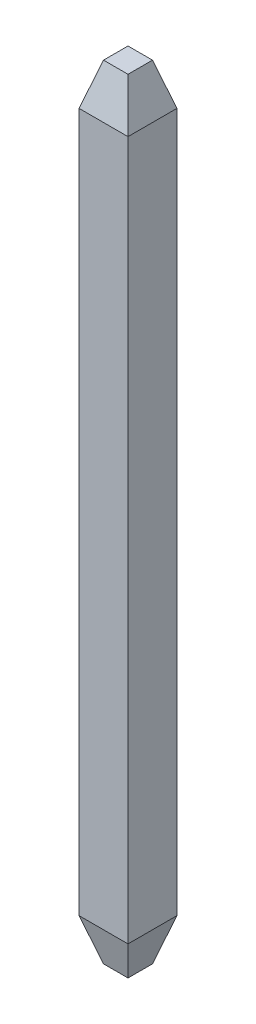
ISO-10303-21;
HEADER;
FILE_DESCRIPTION(('STEP AP214'),'2;1');
FILE_NAME('part.step','',(''),(''),'','','');
FILE_SCHEMA(('AUTOMOTIVE_DESIGN { 1 0 10303 214 1 1 1 1 }'));
ENDSEC;
DATA;
#1=APPLICATION_CONTEXT('core data for automotive mechanical design processes');
#2=APPLICATION_PROTOCOL_DEFINITION('international standard','automotive_design',2000,#1);
#3=PRODUCT_CONTEXT('',#1,'mechanical');
#4=PRODUCT('Part','Part','',(#3));
#5=PRODUCT_RELATED_PRODUCT_CATEGORY('part','',(#4));
#6=PRODUCT_DEFINITION_FORMATION('','',#4);
#7=PRODUCT_DEFINITION_CONTEXT('part definition',#1,'design');
#8=PRODUCT_DEFINITION('design','',#6,#7);
#9=PRODUCT_DEFINITION_SHAPE('','',#8);
#10=(LENGTH_UNIT() NAMED_UNIT(*) SI_UNIT(.MILLI.,.METRE.));
#11=(NAMED_UNIT(*) PLANE_ANGLE_UNIT() SI_UNIT($,.RADIAN.));
#12=(NAMED_UNIT(*) SI_UNIT($,.STERADIAN.) SOLID_ANGLE_UNIT());
#13=UNCERTAINTY_MEASURE_WITH_UNIT(LENGTH_MEASURE(1.E-05),#10,'distance_accuracy_value','');
#14=(GEOMETRIC_REPRESENTATION_CONTEXT(3) GLOBAL_UNCERTAINTY_ASSIGNED_CONTEXT((#13)) GLOBAL_UNIT_ASSIGNED_CONTEXT((#10,
#11,#12)) REPRESENTATION_CONTEXT('',''));
#15=CARTESIAN_POINT('',(0.,0.,0.));
#16=DIRECTION('',(0.,0.,1.));
#17=DIRECTION('',(1.,0.,0.));
#18=AXIS2_PLACEMENT_3D('',#15,#16,#17);
#19=CARTESIAN_POINT('',(-33.8099999999869,-0.965870106912753,-16.9799999999763));
#20=DIRECTION('',(0.95964490090097,0.281214622974636,0.));
#21=DIRECTION('',(0.,0.,-1.));
#22=AXIS2_PLACEMENT_3D('',#19,#20,#21);
#23=PLANE('',#22);
#24=DIRECTION('',(-0.27071401714772,0.923811583516619,0.270714017147728));
#25=VECTOR('',#24,1.);
#26=CARTESIAN_POINT('',(-33.8099999999869,-0.965870106912753,-17.2999999999763));
#27=LINE('',#26,#25);
#28=CARTESIAN_POINT('',(-33.809999999987,-0.965870106912755,-17.2999999999763));
#29=VERTEX_POINT('',#28);
#30=CARTESIAN_POINT('',(-33.969999999987,-0.419870106912756,-17.1399999999763));
#31=VERTEX_POINT('',#30);
#32=EDGE_CURVE('E11',#29,#31,#27,.T.);
#33=ORIENTED_EDGE('',*,*,#32,.T.);
#34=DIRECTION('',(0.,0.,1.));
#35=VECTOR('',#34,1.);
#36=CARTESIAN_POINT('',(-33.9699999999869,-0.419870106912754,-17.1399999999763));
#37=LINE('',#36,#35);
#38=CARTESIAN_POINT('',(-33.969999999987,-0.419870106912756,-16.8199999999763));
#39=VERTEX_POINT('',#38);
#40=EDGE_CURVE('E28',#31,#39,#37,.T.);
#41=ORIENTED_EDGE('',*,*,#40,.T.);
#42=DIRECTION('',(-0.27071401714772,0.923811583516619,-0.270714017147728));
#43=VECTOR('',#42,1.);
#44=CARTESIAN_POINT('',(-33.8099999999869,-0.965870106912753,-16.6599999999763));
#45=LINE('',#44,#43);
#46=CARTESIAN_POINT('',(-33.809999999987,-0.965870106912755,-16.6599999999763));
#47=VERTEX_POINT('',#46);
#48=EDGE_CURVE('E75',#47,#39,#45,.T.);
#49=ORIENTED_EDGE('',*,*,#48,.F.);
#50=DIRECTION('',(0.,0.,1.));
#51=VECTOR('',#50,1.);
#52=CARTESIAN_POINT('',(-33.8099999999869,-0.965870106912753,-17.2999999999763));
#53=LINE('',#52,#51);
#54=EDGE_CURVE('E81',#29,#47,#53,.T.);
#55=ORIENTED_EDGE('',*,*,#54,.F.);
#56=EDGE_LOOP('',(#33,#41,#49,#55));
#57=FACE_BOUND('',#56,.T.);
#58=ADVANCED_FACE('F17',(#57),#23,.T.);
#59=CARTESIAN_POINT('',(-34.1299999999869,-0.965870106912753,-17.2999999999763));
#60=DIRECTION('',(0.,0.281214622974644,-0.959644900900968));
#61=DIRECTION('',(-1.,0.,0.));
#62=AXIS2_PLACEMENT_3D('',#59,#60,#61);
#63=PLANE('',#62);
#64=DIRECTION('',(0.27071401714772,0.923811583516619,0.270714017147728));
#65=VECTOR('',#64,1.);
#66=CARTESIAN_POINT('',(-34.449999999987,-0.965870106912753,-17.2999999999763));
#67=LINE('',#66,#65);
#68=CARTESIAN_POINT('',(-34.449999999987,-0.965870106912755,-17.2999999999763));
#69=VERTEX_POINT('',#68);
#70=CARTESIAN_POINT('',(-34.289999999987,-0.419870106912756,-17.1399999999763));
#71=VERTEX_POINT('',#70);
#72=EDGE_CURVE('E192',#69,#71,#67,.T.);
#73=ORIENTED_EDGE('',*,*,#72,.T.);
#74=DIRECTION('',(1.,0.,0.));
#75=VECTOR('',#74,1.);
#76=CARTESIAN_POINT('',(-34.289999999987,-0.419870106912754,-17.1399999999763));
#77=LINE('',#76,#75);
#78=EDGE_CURVE('E181',#71,#31,#77,.T.);
#79=ORIENTED_EDGE('',*,*,#78,.T.);
#80=ORIENTED_EDGE('',*,*,#32,.F.);
#81=DIRECTION('',(1.,0.,0.));
#82=VECTOR('',#81,1.);
#83=CARTESIAN_POINT('',(-34.449999999987,-0.965870106912753,-17.2999999999763));
#84=LINE('',#83,#82);
#85=EDGE_CURVE('E186',#69,#29,#84,.T.);
#86=ORIENTED_EDGE('',*,*,#85,.F.);
#87=EDGE_LOOP('',(#73,#79,#80,#86));
#88=FACE_BOUND('',#87,.T.);
#89=ADVANCED_FACE('F235',(#88),#63,.T.);
#90=CARTESIAN_POINT('',(-34.449999999987,-0.965870106912753,-16.9799999999763));
#91=DIRECTION('',(-0.95964490090097,0.281214622974636,0.));
#92=DIRECTION('',(0.,0.,1.));
#93=AXIS2_PLACEMENT_3D('',#90,#91,#92);
#94=PLANE('',#93);
#95=DIRECTION('',(0.27071401714772,0.923811583516619,-0.270714017147728));
#96=VECTOR('',#95,1.);
#97=CARTESIAN_POINT('',(-34.449999999987,-0.965870106912753,-16.6599999999763));
#98=LINE('',#97,#96);
#99=CARTESIAN_POINT('',(-34.449999999987,-0.965870106912755,-16.6599999999763));
#100=VERTEX_POINT('',#99);
#101=CARTESIAN_POINT('',(-34.289999999987,-0.419870106912756,-16.8199999999763));
#102=VERTEX_POINT('',#101);
#103=EDGE_CURVE('E158',#100,#102,#98,.T.);
#104=ORIENTED_EDGE('',*,*,#103,.T.);
#105=DIRECTION('',(0.,0.,-1.));
#106=VECTOR('',#105,1.);
#107=CARTESIAN_POINT('',(-34.289999999987,-0.419870106912754,-16.8199999999763));
#108=LINE('',#107,#106);
#109=EDGE_CURVE('E147',#102,#71,#108,.T.);
#110=ORIENTED_EDGE('',*,*,#109,.T.);
#111=ORIENTED_EDGE('',*,*,#72,.F.);
#112=DIRECTION('',(0.,0.,-1.));
#113=VECTOR('',#112,1.);
#114=CARTESIAN_POINT('',(-34.449999999987,-0.965870106912753,-16.6599999999763));
#115=LINE('',#114,#113);
#116=EDGE_CURVE('E148',#100,#69,#115,.T.);
#117=ORIENTED_EDGE('',*,*,#116,.F.);
#118=EDGE_LOOP('',(#104,#110,#111,#117));
#119=FACE_BOUND('',#118,.T.);
#120=ADVANCED_FACE('F239',(#119),#94,.T.);
#121=CARTESIAN_POINT('',(-34.449999999987,-5.53543505344803,-16.6589999999763));
#122=DIRECTION('',(-1.,0.,0.));
#123=DIRECTION('',(0.,0.,1.));
#124=AXIS2_PLACEMENT_3D('',#121,#122,#123);
#125=PLANE('',#124);
#126=DIRECTION('',(0.,1.,0.));
#127=VECTOR('',#126,1.);
#128=CARTESIAN_POINT('',(-34.449999999987,-10.1039999999833,-17.2999999999763));
#129=LINE('',#128,#127);
#130=CARTESIAN_POINT('',(-34.449999999987,-10.1039999999833,-17.2999999999763));
#131=VERTEX_POINT('',#130);
#132=EDGE_CURVE('E21',#131,#69,#129,.T.);
#133=ORIENTED_EDGE('',*,*,#132,.F.);
#134=DIRECTION('',(0.,0.,-1.));
#135=VECTOR('',#134,1.);
#136=CARTESIAN_POINT('',(-34.449999999987,-10.1039999999833,-16.6599999999763));
#137=LINE('',#136,#135);
#138=CARTESIAN_POINT('',(-34.449999999987,-10.1039999999833,-16.6599999999763));
#139=VERTEX_POINT('',#138);
#140=EDGE_CURVE('E185',#139,#131,#137,.T.);
#141=ORIENTED_EDGE('',*,*,#140,.F.);
#142=DIRECTION('',(0.,1.,0.));
#143=VECTOR('',#142,1.);
#144=CARTESIAN_POINT('',(-34.449999999987,-10.1039999999833,-16.6599999999763));
#145=LINE('',#144,#143);
#146=EDGE_CURVE('E144',#139,#100,#145,.T.);
#147=ORIENTED_EDGE('',*,*,#146,.T.);
#148=ORIENTED_EDGE('',*,*,#116,.T.);
#149=EDGE_LOOP('',(#133,#141,#147,#148));
#150=FACE_BOUND('',#149,.T.);
#151=ADVANCED_FACE('F268',(#150),#125,.T.);
#152=CARTESIAN_POINT('',(-34.4509999999869,-5.53543505344803,-16.6599999999763));
#153=DIRECTION('',(0.,0.,1.));
#154=DIRECTION('',(1.,0.,0.));
#155=AXIS2_PLACEMENT_3D('',#152,#153,#154);
#156=PLANE('',#155);
#157=ORIENTED_EDGE('',*,*,#146,.F.);
#158=DIRECTION('',(-1.,0.,0.));
#159=VECTOR('',#158,1.);
#160=CARTESIAN_POINT('',(-33.8099999999869,-10.1039999999833,-16.6599999999763));
#161=LINE('',#160,#159);
#162=CARTESIAN_POINT('',(-33.809999999987,-10.1039999999833,-16.6599999999763));
#163=VERTEX_POINT('',#162);
#164=EDGE_CURVE('E176',#163,#139,#161,.T.);
#165=ORIENTED_EDGE('',*,*,#164,.F.);
#166=DIRECTION('',(0.,1.,0.));
#167=VECTOR('',#166,1.);
#168=CARTESIAN_POINT('',(-33.8099999999869,-10.1039999999833,-16.6599999999763));
#169=LINE('',#168,#167);
#170=EDGE_CURVE('E160',#163,#47,#169,.T.);
#171=ORIENTED_EDGE('',*,*,#170,.T.);
#172=DIRECTION('',(-1.,0.,0.));
#173=VECTOR('',#172,1.);
#174=CARTESIAN_POINT('',(-33.8099999999869,-0.965870106912753,-16.6599999999763));
#175=LINE('',#174,#173);
#176=EDGE_CURVE('E167',#47,#100,#175,.T.);
#177=ORIENTED_EDGE('',*,*,#176,.T.);
#178=EDGE_LOOP('',(#157,#165,#171,#177));
#179=FACE_BOUND('',#178,.T.);
#180=ADVANCED_FACE('F265',(#179),#156,.T.);
#181=CARTESIAN_POINT('',(-34.1299999999869,-10.1039999999833,-16.6599999999763));
#182=DIRECTION('',(0.,-0.281214622974642,0.959644900900969));
#183=DIRECTION('',(-1.,0.,0.));
#184=AXIS2_PLACEMENT_3D('',#181,#182,#183);
#185=PLANE('',#184);
#186=ORIENTED_EDGE('',*,*,#164,.T.);
#187=DIRECTION('',(0.270714017147719,-0.92381158351662,-0.270714017147727));
#188=VECTOR('',#187,1.);
#189=CARTESIAN_POINT('',(-34.449999999987,-10.1039999999833,-16.6599999999763));
#190=LINE('',#189,#188);
#191=CARTESIAN_POINT('',(-34.289999999987,-10.6499999999833,-16.8199999999763));
#192=VERTEX_POINT('',#191);
#193=EDGE_CURVE('E112',#139,#192,#190,.T.);
#194=ORIENTED_EDGE('',*,*,#193,.T.);
#195=DIRECTION('',(-1.,0.,0.));
#196=VECTOR('',#195,1.);
#197=CARTESIAN_POINT('',(-33.9699999999869,-10.6499999999833,-16.8199999999763));
#198=LINE('',#197,#196);
#199=CARTESIAN_POINT('',(-33.969999999987,-10.6499999999833,-16.8199999999763));
#200=VERTEX_POINT('',#199);
#201=EDGE_CURVE('E105',#200,#192,#198,.T.);
#202=ORIENTED_EDGE('',*,*,#201,.F.);
#203=DIRECTION('',(-0.270714017147719,-0.92381158351662,-0.270714017147727));
#204=VECTOR('',#203,1.);
#205=CARTESIAN_POINT('',(-33.8099999999869,-10.1039999999833,-16.6599999999763));
#206=LINE('',#205,#204);
#207=EDGE_CURVE('E109',#163,#200,#206,.T.);
#208=ORIENTED_EDGE('',*,*,#207,.F.);
#209=EDGE_LOOP('',(#186,#194,#202,#208));
#210=FACE_BOUND('',#209,.T.);
#211=ADVANCED_FACE('F108',(#210),#185,.T.);
#212=CARTESIAN_POINT('',(-33.8099999999869,-10.1039999999833,-16.9799999999763));
#213=DIRECTION('',(0.959644900900971,-0.281214622974635,0.));
#214=DIRECTION('',(0.,0.,-1.));
#215=AXIS2_PLACEMENT_3D('',#212,#213,#214);
#216=PLANE('',#215);
#217=DIRECTION('',(0.,0.,1.));
#218=VECTOR('',#217,1.);
#219=CARTESIAN_POINT('',(-33.8099999999869,-10.1039999999833,-17.2999999999763));
#220=LINE('',#219,#218);
#221=CARTESIAN_POINT('',(-33.809999999987,-10.1039999999833,-17.2999999999763));
#222=VERTEX_POINT('',#221);
#223=EDGE_CURVE('E126',#222,#163,#220,.T.);
#224=ORIENTED_EDGE('',*,*,#223,.T.);
#225=ORIENTED_EDGE('',*,*,#207,.T.);
#226=DIRECTION('',(0.,0.,1.));
#227=VECTOR('',#226,1.);
#228=CARTESIAN_POINT('',(-33.9699999999869,-10.6499999999833,-17.1399999999763));
#229=LINE('',#228,#227);
#230=CARTESIAN_POINT('',(-33.969999999987,-10.6499999999833,-17.1399999999763));
#231=VERTEX_POINT('',#230);
#232=EDGE_CURVE('E118',#231,#200,#229,.T.);
#233=ORIENTED_EDGE('',*,*,#232,.F.);
#234=DIRECTION('',(-0.270714017147719,-0.92381158351662,0.270714017147727));
#235=VECTOR('',#234,1.);
#236=CARTESIAN_POINT('',(-33.8099999999869,-10.1039999999833,-17.2999999999763));
#237=LINE('',#236,#235);
#238=EDGE_CURVE('E135',#222,#231,#237,.T.);
#239=ORIENTED_EDGE('',*,*,#238,.F.);
#240=EDGE_LOOP('',(#224,#225,#233,#239));
#241=FACE_BOUND('',#240,.T.);
#242=ADVANCED_FACE('F123',(#241),#216,.T.);
#243=CARTESIAN_POINT('',(-34.1299999999869,-10.1039999999833,-17.2999999999763));
#244=DIRECTION('',(0.,-0.281214622974642,-0.959644900900969));
#245=DIRECTION('',(0.,-0.959644900900969,0.281214622974642));
#246=AXIS2_PLACEMENT_3D('',#243,#244,#245);
#247=PLANE('',#246);
#248=DIRECTION('',(1.,0.,0.));
#249=VECTOR('',#248,1.);
#250=CARTESIAN_POINT('',(-34.449999999987,-10.1039999999833,-17.2999999999763));
#251=LINE('',#250,#249);
#252=EDGE_CURVE('E128',#131,#222,#251,.T.);
#253=ORIENTED_EDGE('',*,*,#252,.T.);
#254=ORIENTED_EDGE('',*,*,#238,.T.);
#255=DIRECTION('',(1.,0.,0.));
#256=VECTOR('',#255,1.);
#257=CARTESIAN_POINT('',(-34.289999999987,-10.6499999999833,-17.1399999999763));
#258=LINE('',#257,#256);
#259=CARTESIAN_POINT('',(-34.289999999987,-10.6499999999833,-17.1399999999763));
#260=VERTEX_POINT('',#259);
#261=EDGE_CURVE('E133',#260,#231,#258,.T.);
#262=ORIENTED_EDGE('',*,*,#261,.F.);
#263=DIRECTION('',(0.270714017147719,-0.92381158351662,0.270714017147727));
#264=VECTOR('',#263,1.);
#265=CARTESIAN_POINT('',(-34.449999999987,-10.1039999999833,-17.2999999999763));
#266=LINE('',#265,#264);
#267=EDGE_CURVE('E182',#131,#260,#266,.T.);
#268=ORIENTED_EDGE('',*,*,#267,.F.);
#269=EDGE_LOOP('',(#253,#254,#262,#268));
#270=FACE_BOUND('',#269,.T.);
#271=ADVANCED_FACE('F224',(#270),#247,.T.);
#272=CARTESIAN_POINT('',(-34.2909999999869,-10.6499999999833,-16.9799999999763));
#273=DIRECTION('',(0.,-1.,0.));
#274=DIRECTION('',(0.,0.,-1.));
#275=AXIS2_PLACEMENT_3D('',#272,#273,#274);
#276=PLANE('',#275);
#277=ORIENTED_EDGE('',*,*,#232,.T.);
#278=ORIENTED_EDGE('',*,*,#201,.T.);
#279=DIRECTION('',(0.,0.,-1.));
#280=VECTOR('',#279,1.);
#281=CARTESIAN_POINT('',(-34.289999999987,-10.6499999999833,-16.8199999999763));
#282=LINE('',#281,#280);
#283=EDGE_CURVE('E119',#192,#260,#282,.T.);
#284=ORIENTED_EDGE('',*,*,#283,.T.);
#285=ORIENTED_EDGE('',*,*,#261,.T.);
#286=EDGE_LOOP('',(#277,#278,#284,#285));
#287=FACE_BOUND('',#286,.T.);
#288=ADVANCED_FACE('F131',(#287),#276,.T.);
#289=CARTESIAN_POINT('',(-34.449999999987,-10.1039999999833,-16.9799999999763));
#290=DIRECTION('',(-0.959644900900971,-0.281214622974635,0.));
#291=DIRECTION('',(-0.281214622974635,0.959644900900971,0.));
#292=AXIS2_PLACEMENT_3D('',#289,#290,#291);
#293=PLANE('',#292);
#294=ORIENTED_EDGE('',*,*,#140,.T.);
#295=ORIENTED_EDGE('',*,*,#267,.T.);
#296=ORIENTED_EDGE('',*,*,#283,.F.);
#297=ORIENTED_EDGE('',*,*,#193,.F.);
#298=EDGE_LOOP('',(#294,#295,#296,#297));
#299=FACE_BOUND('',#298,.T.);
#300=ADVANCED_FACE('F19',(#299),#293,.T.);
#301=CARTESIAN_POINT('',(-33.8089999999869,-5.53443505344803,-17.2999999999763));
#302=DIRECTION('',(0.,0.,-1.));
#303=DIRECTION('',(0.,-1.,0.));
#304=AXIS2_PLACEMENT_3D('',#301,#302,#303);
#305=PLANE('',#304);
#306=DIRECTION('',(0.,1.,0.));
#307=VECTOR('',#306,1.);
#308=CARTESIAN_POINT('',(-33.8099999999869,-10.1039999999833,-17.2999999999763));
#309=LINE('',#308,#307);
#310=EDGE_CURVE('E189',#222,#29,#309,.T.);
#311=ORIENTED_EDGE('',*,*,#310,.F.);
#312=ORIENTED_EDGE('',*,*,#252,.F.);
#313=ORIENTED_EDGE('',*,*,#132,.T.);
#314=ORIENTED_EDGE('',*,*,#85,.T.);
#315=EDGE_LOOP('',(#311,#312,#313,#314));
#316=FACE_BOUND('',#315,.T.);
#317=ADVANCED_FACE('F222',(#316),#305,.T.);
#318=CARTESIAN_POINT('',(-33.8099999999869,-11.0738701069128,-16.9799999999763));
#319=DIRECTION('',(1.,0.,0.));
#320=DIRECTION('',(0.,1.,0.));
#321=AXIS2_PLACEMENT_3D('',#318,#319,#320);
#322=PLANE('',#321);
#323=ORIENTED_EDGE('',*,*,#170,.F.);
#324=ORIENTED_EDGE('',*,*,#223,.F.);
#325=ORIENTED_EDGE('',*,*,#310,.T.);
#326=ORIENTED_EDGE('',*,*,#54,.T.);
#327=EDGE_LOOP('',(#323,#324,#325,#326));
#328=FACE_BOUND('',#327,.T.);
#329=ADVANCED_FACE('F257',(#328),#322,.T.);
#330=CARTESIAN_POINT('',(-34.1299999999869,-0.965870106912753,-16.6599999999763));
#331=DIRECTION('',(0.,0.281214622974644,0.959644900900968));
#332=DIRECTION('',(1.,0.,0.));
#333=AXIS2_PLACEMENT_3D('',#330,#331,#332);
#334=PLANE('',#333);
#335=ORIENTED_EDGE('',*,*,#48,.T.);
#336=DIRECTION('',(-1.,0.,0.));
#337=VECTOR('',#336,1.);
#338=CARTESIAN_POINT('',(-33.9699999999869,-0.419870106912754,-16.8199999999763));
#339=LINE('',#338,#337);
#340=EDGE_CURVE('E201',#39,#102,#339,.T.);
#341=ORIENTED_EDGE('',*,*,#340,.T.);
#342=ORIENTED_EDGE('',*,*,#103,.F.);
#343=ORIENTED_EDGE('',*,*,#176,.F.);
#344=EDGE_LOOP('',(#335,#341,#342,#343));
#345=FACE_BOUND('',#344,.T.);
#346=ADVANCED_FACE('F242',(#345),#334,.T.);
#347=CARTESIAN_POINT('',(-34.129999999987,-0.419870106912754,-17.1409999999763));
#348=DIRECTION('',(0.,1.,0.));
#349=DIRECTION('',(1.,0.,0.));
#350=AXIS2_PLACEMENT_3D('',#347,#348,#349);
#351=PLANE('',#350);
#352=ORIENTED_EDGE('',*,*,#78,.F.);
#353=ORIENTED_EDGE('',*,*,#109,.F.);
#354=ORIENTED_EDGE('',*,*,#340,.F.);
#355=ORIENTED_EDGE('',*,*,#40,.F.);
#356=EDGE_LOOP('',(#352,#353,#354,#355));
#357=FACE_BOUND('',#356,.T.);
#358=ADVANCED_FACE('F237',(#357),#351,.T.);
#359=CLOSED_SHELL('',(#58,#89,#120,#151,#180,#211,#242,#271,#288,#300,#317,#329,#346,#358));
#360=MANIFOLD_SOLID_BREP('B1',#359);
#361=ADVANCED_BREP_SHAPE_REPRESENTATION('',(#18,#360),#14);
#362=SHAPE_DEFINITION_REPRESENTATION(#9,#361);
ENDSEC;
END-ISO-10303-21;
